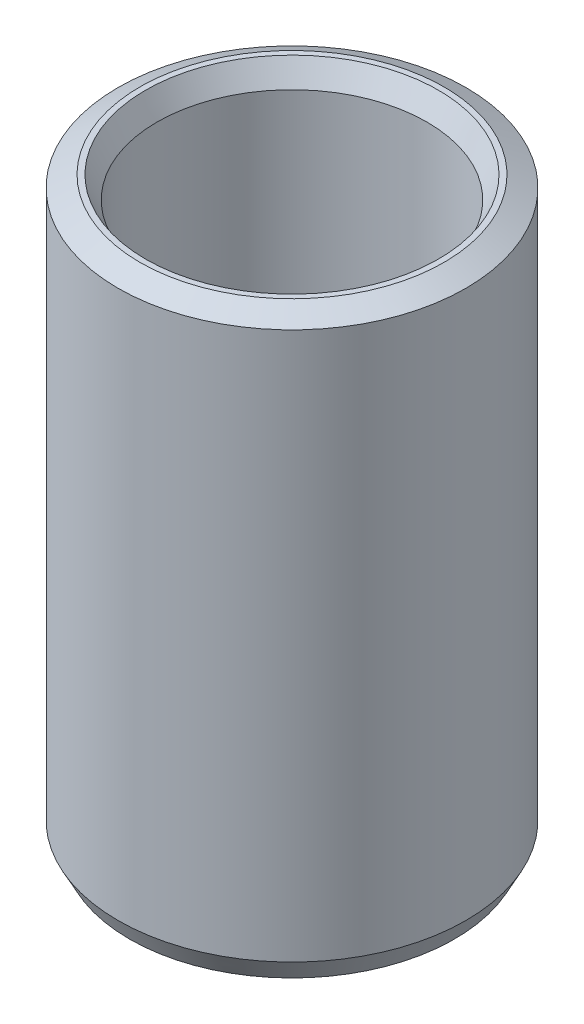
ISO-10303-21;
HEADER;
FILE_DESCRIPTION(('STEP AP214'),'2;1');
FILE_NAME('part.step','',(''),(''),'','','');
FILE_SCHEMA(('AUTOMOTIVE_DESIGN { 1 0 10303 214 1 1 1 1 }'));
ENDSEC;
DATA;
#1=APPLICATION_CONTEXT('core data for automotive mechanical design processes');
#2=APPLICATION_PROTOCOL_DEFINITION('international standard','automotive_design',2000,#1);
#3=PRODUCT_CONTEXT('',#1,'mechanical');
#4=PRODUCT('Part','Part','',(#3));
#5=PRODUCT_RELATED_PRODUCT_CATEGORY('part','',(#4));
#6=PRODUCT_DEFINITION_FORMATION('','',#4);
#7=PRODUCT_DEFINITION_CONTEXT('part definition',#1,'design');
#8=PRODUCT_DEFINITION('design','',#6,#7);
#9=PRODUCT_DEFINITION_SHAPE('','',#8);
#10=(LENGTH_UNIT() NAMED_UNIT(*) SI_UNIT(.MILLI.,.METRE.));
#11=(NAMED_UNIT(*) PLANE_ANGLE_UNIT() SI_UNIT($,.RADIAN.));
#12=(NAMED_UNIT(*) SI_UNIT($,.STERADIAN.) SOLID_ANGLE_UNIT());
#13=UNCERTAINTY_MEASURE_WITH_UNIT(LENGTH_MEASURE(1.E-05),#10,'distance_accuracy_value','');
#14=(GEOMETRIC_REPRESENTATION_CONTEXT(3) GLOBAL_UNCERTAINTY_ASSIGNED_CONTEXT((#13)) GLOBAL_UNIT_ASSIGNED_CONTEXT((#10,
#11,#12)) REPRESENTATION_CONTEXT('',''));
#15=CARTESIAN_POINT('',(0.,0.,0.));
#16=DIRECTION('',(0.,0.,1.));
#17=DIRECTION('',(1.,0.,0.));
#18=AXIS2_PLACEMENT_3D('',#15,#16,#17);
#19=CARTESIAN_POINT('',(0.,41.7506138945807,0.));
#20=DIRECTION('',(0.,-1.,0.));
#21=DIRECTION('',(0.,0.,-1.));
#22=AXIS2_PLACEMENT_3D('',#19,#20,#21);
#23=CYLINDRICAL_SURFACE('',#22,12.5);
#24=CARTESIAN_POINT('',(0.,1.57224841277502,0.));
#25=DIRECTION('',(0.,1.,0.));
#26=DIRECTION('',(0.,0.,1.));
#27=AXIS2_PLACEMENT_3D('',#24,#25,#26);
#28=CIRCLE('',#27,12.5);
#29=CARTESIAN_POINT('',(0.,1.57224841277502,12.5));
#30=VERTEX_POINT('',#29);
#31=EDGE_CURVE('E10',#30,#30,#28,.T.);
#32=ORIENTED_EDGE('',*,*,#31,.T.);
#33=EDGE_LOOP('',(#32));
#34=FACE_BOUND('',#33,.T.);
#35=CARTESIAN_POINT('',(0.,40.9262247045583,0.));
#36=DIRECTION('',(0.,1.,0.));
#37=DIRECTION('',(0.,0.,1.));
#38=AXIS2_PLACEMENT_3D('',#35,#36,#37);
#39=CIRCLE('',#38,12.5);
#40=CARTESIAN_POINT('',(0.,40.9262247045583,12.5));
#41=VERTEX_POINT('',#40);
#42=EDGE_CURVE('E50',#41,#41,#39,.F.);
#43=ORIENTED_EDGE('',*,*,#42,.T.);
#44=EDGE_LOOP('',(#43));
#45=FACE_BOUND('',#44,.T.);
#46=ADVANCED_FACE('F39',(#34,#45),#23,.T.);
#47=CARTESIAN_POINT('',(0.,41.7506138945807,0.));
#48=DIRECTION('',(0.,1.,0.));
#49=DIRECTION('',(0.,0.,1.));
#50=AXIS2_PLACEMENT_3D('',#47,#48,#49);
#51=PLANE('',#50);
#52=CARTESIAN_POINT('',(0.,41.7506138945807,0.));
#53=DIRECTION('',(0.,1.,0.));
#54=DIRECTION('',(0.,0.,1.));
#55=AXIS2_PLACEMENT_3D('',#52,#53,#54);
#56=CIRCLE('',#55,10.5223524466194);
#57=CARTESIAN_POINT('',(0.,41.7506138945807,10.5223524466194));
#58=VERTEX_POINT('',#57);
#59=EDGE_CURVE('E58',#58,#58,#56,.F.);
#60=ORIENTED_EDGE('',*,*,#59,.T.);
#61=EDGE_LOOP('',(#60));
#62=FACE_BOUND('',#61,.T.);
#63=CARTESIAN_POINT('',(0.,41.7506138945807,0.));
#64=DIRECTION('',(0.,1.,0.));
#65=DIRECTION('',(0.,0.,1.));
#66=AXIS2_PLACEMENT_3D('',#63,#64,#65);
#67=CIRCLE('',#66,10.927751587225);
#68=CARTESIAN_POINT('',(0.,41.7506138945807,10.927751587225));
#69=VERTEX_POINT('',#68);
#70=EDGE_CURVE('E61',#69,#69,#67,.T.);
#71=ORIENTED_EDGE('',*,*,#70,.T.);
#72=EDGE_LOOP('',(#71));
#73=FACE_BOUND('',#72,.T.);
#74=ADVANCED_FACE('F88',(#62,#73),#51,.T.);
#75=CARTESIAN_POINT('',(0.,0.,0.));
#76=DIRECTION('',(0.,1.,0.));
#77=DIRECTION('',(0.,0.,1.));
#78=AXIS2_PLACEMENT_3D('',#75,#76,#77);
#79=PLANE('',#78);
#80=CARTESIAN_POINT('',(0.,0.,0.));
#81=DIRECTION('',(0.,1.,0.));
#82=DIRECTION('',(0.,0.,1.));
#83=AXIS2_PLACEMENT_3D('',#80,#81,#82);
#84=CIRCLE('',#83,11.2702116693721);
#85=CARTESIAN_POINT('',(0.,0.,-11.2702116693721));
#86=VERTEX_POINT('',#85);
#87=EDGE_CURVE('E51',#86,#86,#84,.T.);
#88=ORIENTED_EDGE('',*,*,#87,.T.);
#89=EDGE_LOOP('',(#88));
#90=FACE_BOUND('',#89,.T.);
#91=CARTESIAN_POINT('',(0.,0.,0.));
#92=DIRECTION('',(0.,1.,0.));
#93=DIRECTION('',(0.,0.,1.));
#94=AXIS2_PLACEMENT_3D('',#91,#92,#93);
#95=CIRCLE('',#94,11.6756108099777);
#96=CARTESIAN_POINT('',(0.,0.,11.6756108099777));
#97=VERTEX_POINT('',#96);
#98=EDGE_CURVE('E54',#97,#97,#95,.F.);
#99=ORIENTED_EDGE('',*,*,#98,.T.);
#100=EDGE_LOOP('',(#99));
#101=FACE_BOUND('',#100,.T.);
#102=ADVANCED_FACE('F83',(#90,#101),#79,.F.);
#103=CARTESIAN_POINT('',(0.,41.7506138945807,0.));
#104=DIRECTION('',(0.,-1.,0.));
#105=DIRECTION('',(0.,0.,-1.));
#106=AXIS2_PLACEMENT_3D('',#103,#104,#105);
#107=CYLINDRICAL_SURFACE('',#106,9.69796325659714);
#108=CARTESIAN_POINT('',(0.,40.1783654818057,0.));
#109=DIRECTION('',(0.,1.,0.));
#110=DIRECTION('',(0.,0.,1.));
#111=AXIS2_PLACEMENT_3D('',#108,#109,#110);
#112=CIRCLE('',#111,9.69796325659714);
#113=CARTESIAN_POINT('',(0.,40.1783654818057,-9.69796325659714));
#114=VERTEX_POINT('',#113);
#115=EDGE_CURVE('E67',#114,#114,#112,.T.);
#116=CARTESIAN_POINT('',(0.,0.824389190022305,0.));
#117=DIRECTION('',(0.,1.,0.));
#118=DIRECTION('',(0.,0.,1.));
#119=AXIS2_PLACEMENT_3D('',#116,#117,#118);
#120=CIRCLE('',#119,9.69796325659714);
#121=CARTESIAN_POINT('',(0.,0.824389190022298,-9.69796325659714));
#122=VERTEX_POINT('',#121);
#123=EDGE_CURVE('E69',#122,#122,#120,.F.);
#124=CARTESIAN_POINT('',(0.,40.1783654818057,-9.69796325659714));
#125=CARTESIAN_POINT('',(0.,39.7684282287663,-9.69796325659714));
#126=CARTESIAN_POINT('',(0.,39.3584909757268,-9.69796325659714));
#127=CARTESIAN_POINT('',(0.,38.538616469648,-9.69796325659714));
#128=CARTESIAN_POINT('',(0.,38.1286792166086,-9.69796325659714));
#129=CARTESIAN_POINT('',(0.,37.3088047105298,-9.69796325659714));
#130=CARTESIAN_POINT('',(0.,36.8988674574904,-9.69796325659714));
#131=CARTESIAN_POINT('',(0.,36.0789929514116,-9.69796325659714));
#132=CARTESIAN_POINT('',(0.,35.6690556983721,-9.69796325659714));
#133=CARTESIAN_POINT('',(0.,34.8491811922933,-9.69796325659714));
#134=CARTESIAN_POINT('',(0.,34.4392439392539,-9.69796325659714));
#135=CARTESIAN_POINT('',(0.,33.6193694331751,-9.69796325659714));
#136=CARTESIAN_POINT('',(0.,33.2094321801357,-9.69796325659714));
#137=CARTESIAN_POINT('',(0.,32.3895576740569,-9.69796325659714));
#138=CARTESIAN_POINT('',(0.,31.9796204210175,-9.69796325659714));
#139=CARTESIAN_POINT('',(0.,31.1597459149386,-9.69796325659714));
#140=CARTESIAN_POINT('',(0.,30.7498086618992,-9.69796325659714));
#141=CARTESIAN_POINT('',(0.,29.9299341558204,-9.69796325659714));
#142=CARTESIAN_POINT('',(0.,29.519996902781,-9.69796325659714));
#143=CARTESIAN_POINT('',(0.,28.7001223967022,-9.69796325659714));
#144=CARTESIAN_POINT('',(0.,28.2901851436628,-9.69796325659714));
#145=CARTESIAN_POINT('',(0.,27.4703106375839,-9.69796325659714));
#146=CARTESIAN_POINT('',(0.,27.0603733845445,-9.69796325659714));
#147=CARTESIAN_POINT('',(0.,26.2404988784657,-9.69796325659714));
#148=CARTESIAN_POINT('',(0.,25.8305616254263,-9.69796325659714));
#149=CARTESIAN_POINT('',(0.,25.0106871193475,-9.69796325659714));
#150=CARTESIAN_POINT('',(0.,24.6007498663081,-9.69796325659714));
#151=CARTESIAN_POINT('',(0.,23.7808753602293,-9.69796325659714));
#152=CARTESIAN_POINT('',(0.,23.3709381071898,-9.69796325659714));
#153=CARTESIAN_POINT('',(0.,22.551063601111,-9.69796325659714));
#154=CARTESIAN_POINT('',(0.,22.1411263480716,-9.69796325659714));
#155=CARTESIAN_POINT('',(0.,21.3212518419928,-9.69796325659714));
#156=CARTESIAN_POINT('',(0.,20.9113145889534,-9.69796325659714));
#157=CARTESIAN_POINT('',(0.,20.0914400828746,-9.69796325659714));
#158=CARTESIAN_POINT('',(0.,19.6815028298352,-9.69796325659714));
#159=CARTESIAN_POINT('',(0.,18.8616283237563,-9.69796325659714));
#160=CARTESIAN_POINT('',(0.,18.4516910707169,-9.69796325659714));
#161=CARTESIAN_POINT('',(0.,17.6318165646381,-9.69796325659714));
#162=CARTESIAN_POINT('',(0.,17.2218793115987,-9.69796325659714));
#163=CARTESIAN_POINT('',(0.,16.4020048055199,-9.69796325659714));
#164=CARTESIAN_POINT('',(0.,15.9920675524805,-9.69796325659714));
#165=CARTESIAN_POINT('',(0.,15.1721930464016,-9.69796325659714));
#166=CARTESIAN_POINT('',(0.,14.7622557933622,-9.69796325659714));
#167=CARTESIAN_POINT('',(0.,13.9423812872834,-9.69796325659714));
#168=CARTESIAN_POINT('',(0.,13.532444034244,-9.69796325659714));
#169=CARTESIAN_POINT('',(0.,12.7125695281652,-9.69796325659714));
#170=CARTESIAN_POINT('',(0.,12.3026322751258,-9.69796325659714));
#171=CARTESIAN_POINT('',(0.,11.482757769047,-9.69796325659714));
#172=CARTESIAN_POINT('',(0.,11.0728205160075,-9.69796325659714));
#173=CARTESIAN_POINT('',(0.,10.2529460099287,-9.69796325659714));
#174=CARTESIAN_POINT('',(0.,9.84300875688932,-9.69796325659714));
#175=CARTESIAN_POINT('',(0.,9.02313425081049,-9.69796325659714));
#176=CARTESIAN_POINT('',(0.,8.61319699777108,-9.69796325659714));
#177=CARTESIAN_POINT('',(0.,7.79332249169226,-9.69796325659714));
#178=CARTESIAN_POINT('',(0.,7.38338523865285,-9.69796325659714));
#179=CARTESIAN_POINT('',(0.,6.56351073257404,-9.69796325659714));
#180=CARTESIAN_POINT('',(0.,6.15357347953463,-9.69796325659714));
#181=CARTESIAN_POINT('',(0.,5.33369897345581,-9.69796325659714));
#182=CARTESIAN_POINT('',(0.,4.9237617204164,-9.69796325659714));
#183=CARTESIAN_POINT('',(0.,4.10388721433758,-9.69796325659714));
#184=CARTESIAN_POINT('',(0.,3.69394996129817,-9.69796325659714));
#185=CARTESIAN_POINT('',(0.,2.87407545521935,-9.69796325659714));
#186=CARTESIAN_POINT('',(0.,2.46413820217993,-9.69796325659714));
#187=CARTESIAN_POINT('',(0.,1.64426369610111,-9.69796325659714));
#188=CARTESIAN_POINT('',(0.,1.23432644306171,-9.69796325659714));
#189=CARTESIAN_POINT('',(0.,0.824389190022298,-9.69796325659714));
#190=B_SPLINE_CURVE_WITH_KNOTS('',3,(#124,#125,#126,#127,#128,#129,#130,#131,#132,#133,#134,
#135,#136,#137,#138,#139,#140,#141,#142,#143,#144,#145,#146,#147,#148,#149,#150,#151,#152,#153,
#154,#155,#156,#157,#158,#159,#160,#161,#162,#163,#164,#165,#166,#167,#168,#169,#170,#171,#172,
#173,#174,#175,#176,#177,#178,#179,#180,#181,#182,#183,#184,#185,#186,#187,#188,#189),
.UNSPECIFIED.,.F.,.F.,(4,2,2,2,2,2,2,2,2,2,2,2,2,2,2,2,2,2,2,2,2,2,2,2,2,2,2,2,2,2,2,2,4),(0.,
1.22981175911823,2.45962351823646,3.68943527735469,4.91924703647292,6.14905879559115,
7.37887055470939,8.60868231382761,9.83849407294584,11.0683058320641,12.2981175911823,
13.5279293503005,14.7577411094188,15.987552868537,17.2173646276552,18.4471763867735,
19.6769881458917,20.9067999050099,22.1366116641281,23.3664234232464,24.5962351823646,
25.8260469414828,27.0558587006011,28.2856704597193,29.5154822188375,30.7452939779558,
31.975105737074,33.2049174961922,34.4347292553104,35.6645410144287,36.8943527735469,
38.1241645326651,39.3539762917834),.UNSPECIFIED.);
#191=EDGE_CURVE('BSEAM71',#114,#122,#190,.T.);
#192=ORIENTED_EDGE('',*,*,#115,.T.);
#193=ORIENTED_EDGE('',*,*,#123,.T.);
#194=ORIENTED_EDGE('',*,*,#191,.T.);
#195=ORIENTED_EDGE('',*,*,#191,.F.);
#196=EDGE_LOOP('',(#192,#194,#193,#195));
#197=FACE_BOUND('',#196,.T.);
#198=ADVANCED_FACE('F71',(#197),#107,.F.);
#199=CARTESIAN_POINT('',(0.,40.1783654818057,0.));
#200=DIRECTION('',(0.,1.,0.));
#201=DIRECTION('',(0.,0.,1.));
#202=AXIS2_PLACEMENT_3D('',#199,#200,#201);
#203=CONICAL_SURFACE('',#202,9.69796325659714,0.482927700218423);
#204=ORIENTED_EDGE('',*,*,#59,.F.);
#205=EDGE_LOOP('',(#204));
#206=FACE_BOUND('',#205,.T.);
#207=ORIENTED_EDGE('',*,*,#115,.F.);
#208=EDGE_LOOP('',(#207));
#209=FACE_BOUND('',#208,.T.);
#210=ADVANCED_FACE('F77',(#206,#209),#203,.F.);
#211=CARTESIAN_POINT('',(0.,0.,0.));
#212=DIRECTION('',(0.,-1.,0.));
#213=DIRECTION('',(0.,0.,-1.));
#214=AXIS2_PLACEMENT_3D('',#211,#212,#213);
#215=CONICAL_SURFACE('',#214,11.2702116693721,1.08786862657647);
#216=CARTESIAN_POINT('',(0.,0.824389190022305,-9.69796325659714));
#217=CARTESIAN_POINT('',(0.,0.815801802626239,-9.71434084423021));
#218=CARTESIAN_POINT('',(0.,0.807214415230174,-9.73071843186329));
#219=CARTESIAN_POINT('',(0.,0.790039640438042,-9.76347360712943));
#220=CARTESIAN_POINT('',(0.,0.781452253041977,-9.77985119476251));
#221=CARTESIAN_POINT('',(0.,0.764277478249845,-9.81260637002865));
#222=CARTESIAN_POINT('',(0.,0.75569009085378,-9.82898395766172));
#223=CARTESIAN_POINT('',(0.,0.738515316061648,-9.86173913292787));
#224=CARTESIAN_POINT('',(0.,0.729927928665583,-9.87811672056094));
#225=CARTESIAN_POINT('',(0.,0.712753153873451,-9.91087189582709));
#226=CARTESIAN_POINT('',(0.,0.704165766477386,-9.92724948346016));
#227=CARTESIAN_POINT('',(0.,0.686990991685254,-9.9600046587263));
#228=CARTESIAN_POINT('',(0.,0.678403604289189,-9.97638224635938));
#229=CARTESIAN_POINT('',(0.,0.661228829497057,-10.0091374216255));
#230=CARTESIAN_POINT('',(0.,0.652641442100992,-10.0255150092586));
#231=CARTESIAN_POINT('',(0.,0.63546666730886,-10.0582701845247));
#232=CARTESIAN_POINT('',(0.,0.626879279912794,-10.0746477721578));
#233=CARTESIAN_POINT('',(0.,0.609704505120663,-10.107402947424));
#234=CARTESIAN_POINT('',(0.,0.601117117724597,-10.123780535057));
#235=CARTESIAN_POINT('',(0.,0.583942342932466,-10.1565357103232));
#236=CARTESIAN_POINT('',(0.,0.5753549555364,-10.1729132979563));
#237=CARTESIAN_POINT('',(0.,0.558180180744269,-10.2056684732224));
#238=CARTESIAN_POINT('',(0.,0.549592793348203,-10.2220460608555));
#239=CARTESIAN_POINT('',(0.,0.532418018556072,-10.2548012361216));
#240=CARTESIAN_POINT('',(0.,0.523830631160006,-10.2711788237547));
#241=CARTESIAN_POINT('',(0.,0.506655856367875,-10.3039339990208));
#242=CARTESIAN_POINT('',(0.,0.498068468971809,-10.3203115866539));
#243=CARTESIAN_POINT('',(0.,0.480893694179678,-10.35306676192));
#244=CARTESIAN_POINT('',(0.,0.472306306783612,-10.3694443495531));
#245=CARTESIAN_POINT('',(0.,0.455131531991481,-10.4021995248193));
#246=CARTESIAN_POINT('',(0.,0.446544144595415,-10.4185771124523));
#247=CARTESIAN_POINT('',(0.,0.429369369803284,-10.4513322877185));
#248=CARTESIAN_POINT('',(0.,0.420781982407218,-10.4677098753516));
#249=CARTESIAN_POINT('',(0.,0.403607207615087,-10.5004650506177));
#250=CARTESIAN_POINT('',(0.,0.395019820219021,-10.5168426382508));
#251=CARTESIAN_POINT('',(0.,0.37784504542689,-10.5495978135169));
#252=CARTESIAN_POINT('',(0.,0.369257658030824,-10.56597540115));
#253=CARTESIAN_POINT('',(0.,0.352082883238693,-10.5987305764161));
#254=CARTESIAN_POINT('',(0.,0.343495495842627,-10.6151081640492));
#255=CARTESIAN_POINT('',(0.,0.326320721050496,-10.6478633393154));
#256=CARTESIAN_POINT('',(0.,0.31773333365443,-10.6642409269484));
#257=CARTESIAN_POINT('',(0.,0.300558558862299,-10.6969961022146));
#258=CARTESIAN_POINT('',(0.,0.291971171466233,-10.7133736898477));
#259=CARTESIAN_POINT('',(0.,0.274796396674102,-10.7461288651138));
#260=CARTESIAN_POINT('',(0.,0.266209009278036,-10.7625064527469));
#261=CARTESIAN_POINT('',(0.,0.249034234485905,-10.795261628013));
#262=CARTESIAN_POINT('',(0.,0.240446847089839,-10.8116392156461));
#263=CARTESIAN_POINT('',(0.,0.223272072297708,-10.8443943909122));
#264=CARTESIAN_POINT('',(0.,0.214684684901642,-10.8607719785453));
#265=CARTESIAN_POINT('',(0.,0.197509910109511,-10.8935271538114));
#266=CARTESIAN_POINT('',(0.,0.188922522713445,-10.9099047414445));
#267=CARTESIAN_POINT('',(0.,0.171747747921314,-10.9426599167107));
#268=CARTESIAN_POINT('',(0.,0.163160360525248,-10.9590375043437));
#269=CARTESIAN_POINT('',(0.,0.145985585733117,-10.9917926796099));
#270=CARTESIAN_POINT('',(0.,0.137398198337051,-11.008170267243));
#271=CARTESIAN_POINT('',(0.,0.120223423544919,-11.0409254425091));
#272=CARTESIAN_POINT('',(0.,0.111636036148854,-11.0573030301422));
#273=CARTESIAN_POINT('',(0.,0.0944612613567225,-11.0900582054083));
#274=CARTESIAN_POINT('',(0.,0.0858738739606568,-11.1064357930414));
#275=CARTESIAN_POINT('',(0.,0.0686990991685254,-11.1391909683075));
#276=CARTESIAN_POINT('',(0.,0.0601117117724597,-11.1555685559406));
#277=CARTESIAN_POINT('',(0.,0.0429369369803284,-11.1883237312068));
#278=CARTESIAN_POINT('',(0.,0.0343495495842627,-11.2047013188398));
#279=CARTESIAN_POINT('',(0.,0.0171747747921314,-11.237456494106));
#280=CARTESIAN_POINT('',(0.,0.00858738739606567,-11.2538340817391));
#281=CARTESIAN_POINT('',(0.,0.,-11.2702116693721));
#282=B_SPLINE_CURVE_WITH_KNOTS('',3,(#216,#217,#218,#219,#220,#221,#222,#223,#224,#225,#226,
#227,#228,#229,#230,#231,#232,#233,#234,#235,#236,#237,#238,#239,#240,#241,#242,#243,#244,#245,
#246,#247,#248,#249,#250,#251,#252,#253,#254,#255,#256,#257,#258,#259,#260,#261,#262,#263,#264,
#265,#266,#267,#268,#269,#270,#271,#272,#273,#274,#275,#276,#277,#278,#279,#280,#281),
.UNSPECIFIED.,.F.,.F.,(4,2,2,2,2,2,2,2,2,2,2,2,2,2,2,2,2,2,2,2,2,2,2,2,2,2,2,2,2,2,2,2,4),(0.,
0.0554771790083251,0.11095435801665,0.166431537024975,0.221908716033301,0.277385895041626,
0.332863074049951,0.388340253058276,0.443817432066601,0.499294611074926,0.554771790083251,
0.610248969091577,0.665726148099902,0.721203327108227,0.776680506116552,0.832157685124877,
0.887634864133204,0.943112043141529,0.998589222149854,1.05406640115818,1.1095435801665,
1.16502075917483,1.22049793818315,1.27597511719148,1.3314522961998,1.38692947520813,
1.44240665421645,1.49788383322478,1.5533610122331,1.60883819124143,1.66431537024975,
1.71979254925808,1.7752697282664),.UNSPECIFIED.);
#283=EDGE_CURVE('BSEAM73',#122,#86,#282,.T.);
#284=ORIENTED_EDGE('',*,*,#123,.F.);
#285=ORIENTED_EDGE('',*,*,#87,.F.);
#286=ORIENTED_EDGE('',*,*,#283,.T.);
#287=ORIENTED_EDGE('',*,*,#283,.F.);
#288=EDGE_LOOP('',(#284,#286,#285,#287));
#289=FACE_BOUND('',#288,.T.);
#290=ADVANCED_FACE('F73',(#289),#215,.F.);
#291=CARTESIAN_POINT('',(0.,1.57224841277502,0.));
#292=DIRECTION('',(0.,1.,0.));
#293=DIRECTION('',(0.,0.,1.));
#294=AXIS2_PLACEMENT_3D('',#291,#292,#293);
#295=CONICAL_SURFACE('',#294,12.5,0.482927700218424);
#296=ORIENTED_EDGE('',*,*,#98,.F.);
#297=EDGE_LOOP('',(#296));
#298=FACE_BOUND('',#297,.T.);
#299=ORIENTED_EDGE('',*,*,#31,.F.);
#300=EDGE_LOOP('',(#299));
#301=FACE_BOUND('',#300,.T.);
#302=ADVANCED_FACE('F76',(#298,#301),#295,.T.);
#303=CARTESIAN_POINT('',(0.,41.7506138945807,0.));
#304=DIRECTION('',(0.,-1.,0.));
#305=DIRECTION('',(0.,0.,-1.));
#306=AXIS2_PLACEMENT_3D('',#303,#304,#305);
#307=CONICAL_SURFACE('',#306,10.927751587225,1.08786862657647);
#308=ORIENTED_EDGE('',*,*,#42,.F.);
#309=EDGE_LOOP('',(#308));
#310=FACE_BOUND('',#309,.T.);
#311=ORIENTED_EDGE('',*,*,#70,.F.);
#312=EDGE_LOOP('',(#311));
#313=FACE_BOUND('',#312,.T.);
#314=ADVANCED_FACE('F45',(#310,#313),#307,.T.);
#315=CLOSED_SHELL('',(#46,#74,#102,#198,#210,#290,#302,#314));
#316=MANIFOLD_SOLID_BREP('B2',#315);
#317=ADVANCED_BREP_SHAPE_REPRESENTATION('',(#18,#316),#14);
#318=SHAPE_DEFINITION_REPRESENTATION(#9,#317);
ENDSEC;
END-ISO-10303-21;
